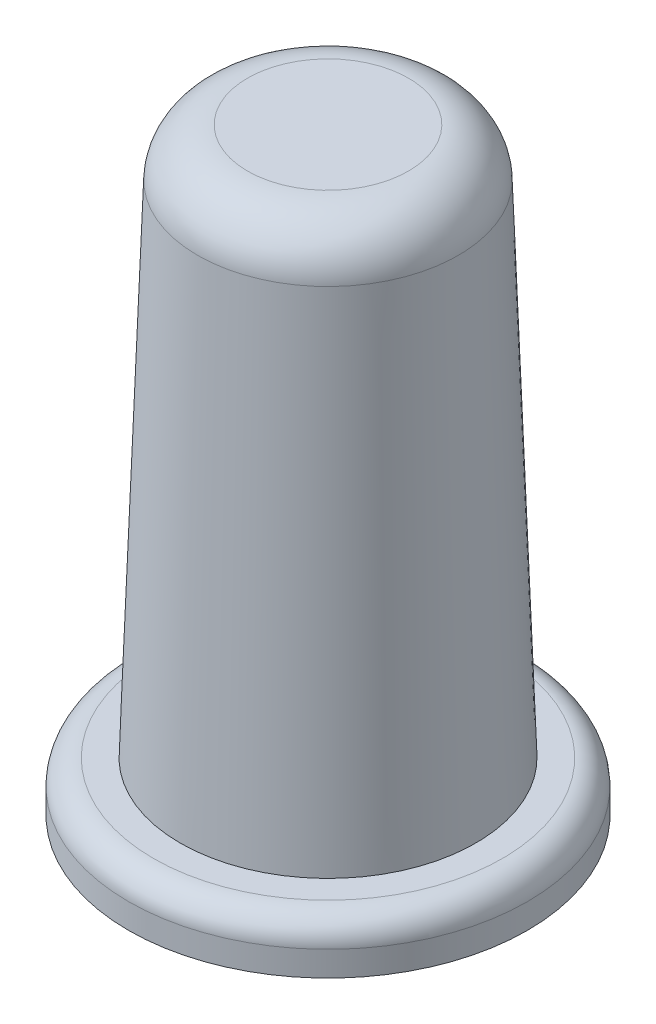
ISO-10303-21;
HEADER;
FILE_DESCRIPTION(('STEP AP214'),'2;1');
FILE_NAME('part.step','',(''),(''),'','','');
FILE_SCHEMA(('AUTOMOTIVE_DESIGN { 1 0 10303 214 1 1 1 1 }'));
ENDSEC;
DATA;
#1=APPLICATION_CONTEXT('core data for automotive mechanical design processes');
#2=APPLICATION_PROTOCOL_DEFINITION('international standard','automotive_design',2000,#1);
#3=PRODUCT_CONTEXT('',#1,'mechanical');
#4=PRODUCT('Part','Part','',(#3));
#5=PRODUCT_RELATED_PRODUCT_CATEGORY('part','',(#4));
#6=PRODUCT_DEFINITION_FORMATION('','',#4);
#7=PRODUCT_DEFINITION_CONTEXT('part definition',#1,'design');
#8=PRODUCT_DEFINITION('design','',#6,#7);
#9=PRODUCT_DEFINITION_SHAPE('','',#8);
#10=(LENGTH_UNIT() NAMED_UNIT(*) SI_UNIT(.MILLI.,.METRE.));
#11=(NAMED_UNIT(*) PLANE_ANGLE_UNIT() SI_UNIT($,.RADIAN.));
#12=(NAMED_UNIT(*) SI_UNIT($,.STERADIAN.) SOLID_ANGLE_UNIT());
#13=UNCERTAINTY_MEASURE_WITH_UNIT(LENGTH_MEASURE(1.E-05),#10,'distance_accuracy_value','');
#14=(GEOMETRIC_REPRESENTATION_CONTEXT(3) GLOBAL_UNCERTAINTY_ASSIGNED_CONTEXT((#13)) GLOBAL_UNIT_ASSIGNED_CONTEXT((#10,
#11,#12)) REPRESENTATION_CONTEXT('',''));
#15=CARTESIAN_POINT('',(0.,0.,0.));
#16=DIRECTION('',(0.,0.,1.));
#17=DIRECTION('',(1.,0.,0.));
#18=AXIS2_PLACEMENT_3D('',#15,#16,#17);
#19=CARTESIAN_POINT('',(0.,0.,0.));
#20=DIRECTION('',(0.,-1.,0.));
#21=DIRECTION('',(0.,0.,1.));
#22=AXIS2_PLACEMENT_3D('',#19,#20,#21);
#23=CONICAL_SURFACE('',#22,38.1,0.0349065850398867);
#24=CARTESIAN_POINT('',(0.,12.7,0.));
#25=DIRECTION('',(0.,1.,0.));
#26=DIRECTION('',(0.,0.,1.));
#27=AXIS2_PLACEMENT_3D('',#24,#25,#26);
#28=CIRCLE('',#27,37.6565062274548);
#29=CARTESIAN_POINT('',(0.,12.7,37.6565062274548));
#30=VERTEX_POINT('',#29);
#31=EDGE_CURVE('E64',#30,#30,#28,.T.);
#32=ORIENTED_EDGE('',*,*,#31,.T.);
#33=EDGE_LOOP('',(#32));
#34=FACE_BOUND('',#33,.T.);
#35=CARTESIAN_POINT('',(0.,140.143223608122,0.));
#36=DIRECTION('',(0.,-1.,0.));
#37=DIRECTION('',(0.,0.,-1.));
#38=AXIS2_PLACEMENT_3D('',#35,#36,#37);
#39=CIRCLE('',#38,33.2060907925503);
#40=CARTESIAN_POINT('',(0.,140.143223608122,-33.2060907925503));
#41=VERTEX_POINT('',#40);
#42=EDGE_CURVE('E56',#41,#41,#39,.T.);
#43=ORIENTED_EDGE('',*,*,#42,.T.);
#44=EDGE_LOOP('',(#43));
#45=FACE_BOUND('',#44,.T.);
#46=ADVANCED_FACE('F43',(#34,#45),#23,.T.);
#47=CARTESIAN_POINT('',(0.,152.4,0.));
#48=DIRECTION('',(0.,1.,0.));
#49=DIRECTION('',(0.,0.,1.));
#50=AXIS2_PLACEMENT_3D('',#47,#48,#49);
#51=PLANE('',#50);
#52=CARTESIAN_POINT('',(0.,152.4,0.));
#53=DIRECTION('',(0.,1.,0.));
#54=DIRECTION('',(0.,0.,1.));
#55=AXIS2_PLACEMENT_3D('',#52,#53,#54);
#56=CIRCLE('',#55,20.5138272894078);
#57=CARTESIAN_POINT('',(0.,152.4,20.5138272894078));
#58=VERTEX_POINT('',#57);
#59=EDGE_CURVE('E61',#58,#58,#56,.T.);
#60=ORIENTED_EDGE('',*,*,#59,.T.);
#61=EDGE_LOOP('',(#60));
#62=FACE_BOUND('',#61,.T.);
#63=ADVANCED_FACE('F91',(#62),#51,.T.);
#64=CARTESIAN_POINT('',(0.,139.7,0.));
#65=DIRECTION('',(0.,1.,0.));
#66=DIRECTION('',(0.,0.,1.));
#67=AXIS2_PLACEMENT_3D('',#64,#65,#66);
#68=TOROIDAL_SURFACE('',#67,20.5138272894078,12.7);
#69=ORIENTED_EDGE('',*,*,#42,.F.);
#70=EDGE_LOOP('',(#69));
#71=FACE_BOUND('',#70,.T.);
#72=ORIENTED_EDGE('',*,*,#59,.F.);
#73=EDGE_LOOP('',(#72));
#74=FACE_BOUND('',#73,.T.);
#75=ADVANCED_FACE('F96',(#71,#74),#68,.T.);
#76=CARTESIAN_POINT('',(0.,12.7,0.));
#77=DIRECTION('',(0.,-1.,0.));
#78=DIRECTION('',(0.,0.,-1.));
#79=AXIS2_PLACEMENT_3D('',#76,#77,#78);
#80=CYLINDRICAL_SURFACE('',#79,50.8);
#81=CARTESIAN_POINT('',(0.,6.35,0.));
#82=DIRECTION('',(0.,1.,0.));
#83=DIRECTION('',(0.,0.,1.));
#84=AXIS2_PLACEMENT_3D('',#81,#82,#83);
#85=CIRCLE('',#84,50.8);
#86=CARTESIAN_POINT('',(0.,6.35,50.8));
#87=VERTEX_POINT('',#86);
#88=EDGE_CURVE('E10',#87,#87,#85,.F.);
#89=ORIENTED_EDGE('',*,*,#88,.T.);
#90=EDGE_LOOP('',(#89));
#91=FACE_BOUND('',#90,.T.);
#92=CARTESIAN_POINT('',(0.,0.,0.));
#93=DIRECTION('',(0.,1.,0.));
#94=DIRECTION('',(0.,0.,1.));
#95=AXIS2_PLACEMENT_3D('',#92,#93,#94);
#96=CIRCLE('',#95,50.8);
#97=CARTESIAN_POINT('',(0.,0.,50.8));
#98=VERTEX_POINT('',#97);
#99=EDGE_CURVE('E67',#98,#98,#96,.T.);
#100=ORIENTED_EDGE('',*,*,#99,.T.);
#101=EDGE_LOOP('',(#100));
#102=FACE_BOUND('',#101,.T.);
#103=ADVANCED_FACE('F76',(#91,#102),#80,.T.);
#104=CARTESIAN_POINT('',(0.,12.7,0.));
#105=DIRECTION('',(0.,1.,0.));
#106=DIRECTION('',(0.,0.,1.));
#107=AXIS2_PLACEMENT_3D('',#104,#105,#106);
#108=PLANE('',#107);
#109=CARTESIAN_POINT('',(0.,12.7,0.));
#110=DIRECTION('',(0.,1.,0.));
#111=DIRECTION('',(0.,0.,1.));
#112=AXIS2_PLACEMENT_3D('',#109,#110,#111);
#113=CIRCLE('',#112,44.45);
#114=CARTESIAN_POINT('',(0.,12.7,44.45));
#115=VERTEX_POINT('',#114);
#116=EDGE_CURVE('E51',#115,#115,#113,.T.);
#117=ORIENTED_EDGE('',*,*,#116,.T.);
#118=EDGE_LOOP('',(#117));
#119=FACE_BOUND('',#118,.T.);
#120=ORIENTED_EDGE('',*,*,#31,.F.);
#121=EDGE_LOOP('',(#120));
#122=FACE_BOUND('',#121,.T.);
#123=ADVANCED_FACE('F80',(#119,#122),#108,.T.);
#124=CARTESIAN_POINT('',(0.,0.,0.));
#125=DIRECTION('',(0.,1.,0.));
#126=DIRECTION('',(0.,0.,1.));
#127=AXIS2_PLACEMENT_3D('',#124,#125,#126);
#128=PLANE('',#127);
#129=ORIENTED_EDGE('',*,*,#99,.F.);
#130=EDGE_LOOP('',(#129));
#131=FACE_BOUND('',#130,.T.);
#132=ADVANCED_FACE('F78',(#131),#128,.F.);
#133=CARTESIAN_POINT('',(0.,6.35,0.));
#134=DIRECTION('',(0.,1.,0.));
#135=DIRECTION('',(0.,0.,1.));
#136=AXIS2_PLACEMENT_3D('',#133,#134,#135);
#137=TOROIDAL_SURFACE('',#136,44.45,6.35);
#138=ORIENTED_EDGE('',*,*,#88,.F.);
#139=EDGE_LOOP('',(#138));
#140=FACE_BOUND('',#139,.T.);
#141=ORIENTED_EDGE('',*,*,#116,.F.);
#142=EDGE_LOOP('',(#141));
#143=FACE_BOUND('',#142,.T.);
#144=ADVANCED_FACE('F45',(#140,#143),#137,.T.);
#145=CLOSED_SHELL('',(#46,#63,#75,#103,#123,#132,#144));
#146=MANIFOLD_SOLID_BREP('B2',#145);
#147=ADVANCED_BREP_SHAPE_REPRESENTATION('',(#18,#146),#14);
#148=SHAPE_DEFINITION_REPRESENTATION(#9,#147);
ENDSEC;
END-ISO-10303-21;
